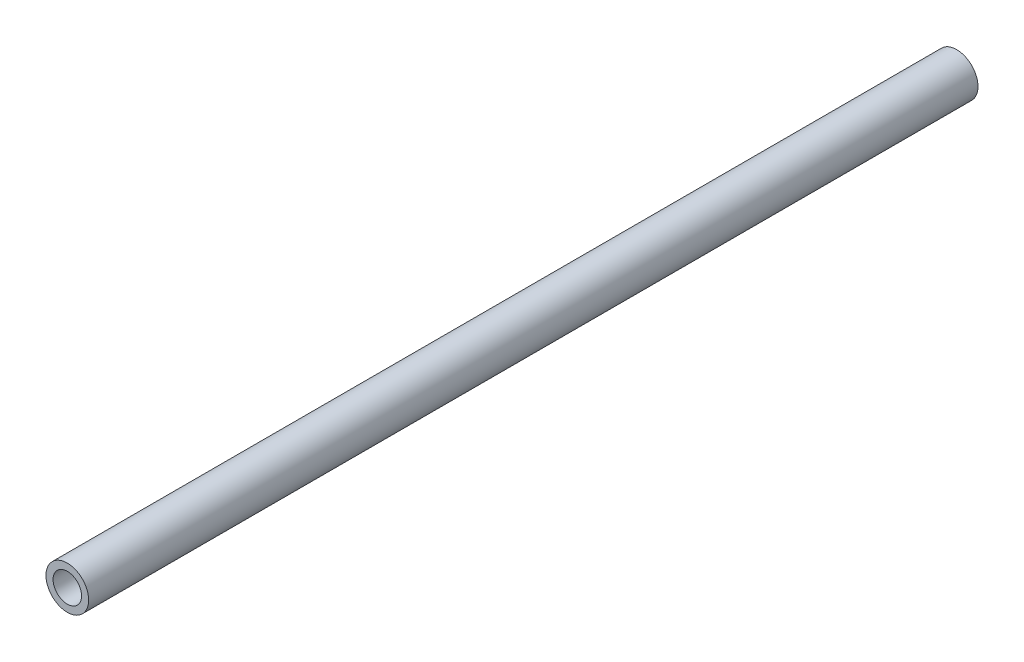
ISO-10303-21;
HEADER;
FILE_DESCRIPTION(('STEP AP214'),'2;1');
FILE_NAME('part.step','',(''),(''),'','','');
FILE_SCHEMA(('AUTOMOTIVE_DESIGN { 1 0 10303 214 1 1 1 1 }'));
ENDSEC;
DATA;
#1=APPLICATION_CONTEXT('core data for automotive mechanical design processes');
#2=APPLICATION_PROTOCOL_DEFINITION('international standard','automotive_design',2000,#1);
#3=PRODUCT_CONTEXT('',#1,'mechanical');
#4=PRODUCT('Part','Part','',(#3));
#5=PRODUCT_RELATED_PRODUCT_CATEGORY('part','',(#4));
#6=PRODUCT_DEFINITION_FORMATION('','',#4);
#7=PRODUCT_DEFINITION_CONTEXT('part definition',#1,'design');
#8=PRODUCT_DEFINITION('design','',#6,#7);
#9=PRODUCT_DEFINITION_SHAPE('','',#8);
#10=(LENGTH_UNIT() NAMED_UNIT(*) SI_UNIT(.MILLI.,.METRE.));
#11=(NAMED_UNIT(*) PLANE_ANGLE_UNIT() SI_UNIT($,.RADIAN.));
#12=(NAMED_UNIT(*) SI_UNIT($,.STERADIAN.) SOLID_ANGLE_UNIT());
#13=UNCERTAINTY_MEASURE_WITH_UNIT(LENGTH_MEASURE(1.E-05),#10,'distance_accuracy_value','');
#14=(GEOMETRIC_REPRESENTATION_CONTEXT(3) GLOBAL_UNCERTAINTY_ASSIGNED_CONTEXT((#13)) GLOBAL_UNIT_ASSIGNED_CONTEXT((#10,
#11,#12)) REPRESENTATION_CONTEXT('',''));
#15=CARTESIAN_POINT('',(0.,0.,0.));
#16=DIRECTION('',(0.,0.,1.));
#17=DIRECTION('',(1.,0.,0.));
#18=AXIS2_PLACEMENT_3D('',#15,#16,#17);
#19=CARTESIAN_POINT('',(0.,0.,317.5));
#20=DIRECTION('',(0.,0.,1.));
#21=DIRECTION('',(1.,0.,0.));
#22=AXIS2_PLACEMENT_3D('',#19,#20,#21);
#23=PLANE('',#22);
#24=CARTESIAN_POINT('',(0.,0.,317.5));
#25=DIRECTION('',(0.,0.,1.));
#26=DIRECTION('',(1.,0.,0.));
#27=AXIS2_PLACEMENT_3D('',#24,#25,#26);
#28=CIRCLE('',#27,7.62);
#29=CARTESIAN_POINT('',(7.62,0.,317.5));
#30=VERTEX_POINT('',#29);
#31=EDGE_CURVE('E10',#30,#30,#28,.T.);
#32=ORIENTED_EDGE('',*,*,#31,.T.);
#33=EDGE_LOOP('',(#32));
#34=FACE_BOUND('',#33,.T.);
#35=CARTESIAN_POINT('',(0.,0.,317.5));
#36=DIRECTION('',(0.,0.,1.));
#37=DIRECTION('',(1.,0.,0.));
#38=AXIS2_PLACEMENT_3D('',#35,#36,#37);
#39=CIRCLE('',#38,5.08);
#40=CARTESIAN_POINT('',(5.08,0.,317.5));
#41=VERTEX_POINT('',#40);
#42=EDGE_CURVE('E41',#41,#41,#39,.T.);
#43=ORIENTED_EDGE('',*,*,#42,.F.);
#44=EDGE_LOOP('',(#43));
#45=FACE_BOUND('',#44,.T.);
#46=ADVANCED_FACE('F30',(#34,#45),#23,.T.);
#47=CARTESIAN_POINT('',(0.,0.,0.));
#48=DIRECTION('',(0.,0.,1.));
#49=DIRECTION('',(1.,0.,0.));
#50=AXIS2_PLACEMENT_3D('',#47,#48,#49);
#51=PLANE('',#50);
#52=CARTESIAN_POINT('',(0.,0.,0.));
#53=DIRECTION('',(0.,0.,1.));
#54=DIRECTION('',(1.,0.,0.));
#55=AXIS2_PLACEMENT_3D('',#52,#53,#54);
#56=CIRCLE('',#55,7.62);
#57=CARTESIAN_POINT('',(7.62,0.,0.));
#58=VERTEX_POINT('',#57);
#59=EDGE_CURVE('E34',#58,#58,#56,.T.);
#60=ORIENTED_EDGE('',*,*,#59,.F.);
#61=EDGE_LOOP('',(#60));
#62=FACE_BOUND('',#61,.T.);
#63=CARTESIAN_POINT('',(0.,0.,0.));
#64=DIRECTION('',(0.,0.,1.));
#65=DIRECTION('',(1.,0.,0.));
#66=AXIS2_PLACEMENT_3D('',#63,#64,#65);
#67=CIRCLE('',#66,5.08);
#68=CARTESIAN_POINT('',(5.08,0.,0.));
#69=VERTEX_POINT('',#68);
#70=EDGE_CURVE('E43',#69,#69,#67,.T.);
#71=ORIENTED_EDGE('',*,*,#70,.T.);
#72=EDGE_LOOP('',(#71));
#73=FACE_BOUND('',#72,.T.);
#74=ADVANCED_FACE('F53',(#62,#73),#51,.F.);
#75=CARTESIAN_POINT('',(0.,0.,317.5));
#76=DIRECTION('',(0.,0.,-1.));
#77=DIRECTION('',(-1.,0.,0.));
#78=AXIS2_PLACEMENT_3D('',#75,#76,#77);
#79=CYLINDRICAL_SURFACE('',#78,7.62);
#80=ORIENTED_EDGE('',*,*,#31,.F.);
#81=EDGE_LOOP('',(#80));
#82=FACE_BOUND('',#81,.T.);
#83=ORIENTED_EDGE('',*,*,#59,.T.);
#84=EDGE_LOOP('',(#83));
#85=FACE_BOUND('',#84,.T.);
#86=ADVANCED_FACE('F32',(#82,#85),#79,.T.);
#87=CARTESIAN_POINT('',(0.,0.,317.5));
#88=DIRECTION('',(0.,0.,-1.));
#89=DIRECTION('',(-1.,0.,0.));
#90=AXIS2_PLACEMENT_3D('',#87,#88,#89);
#91=CYLINDRICAL_SURFACE('',#90,5.08);
#92=ORIENTED_EDGE('',*,*,#42,.T.);
#93=EDGE_LOOP('',(#92));
#94=FACE_BOUND('',#93,.T.);
#95=ORIENTED_EDGE('',*,*,#70,.F.);
#96=EDGE_LOOP('',(#95));
#97=FACE_BOUND('',#96,.T.);
#98=ADVANCED_FACE('F49',(#94,#97),#91,.F.);
#99=CLOSED_SHELL('',(#46,#74,#86,#98));
#100=MANIFOLD_SOLID_BREP('B2',#99);
#101=ADVANCED_BREP_SHAPE_REPRESENTATION('',(#18,#100),#14);
#102=SHAPE_DEFINITION_REPRESENTATION(#9,#101);
ENDSEC;
END-ISO-10303-21;
